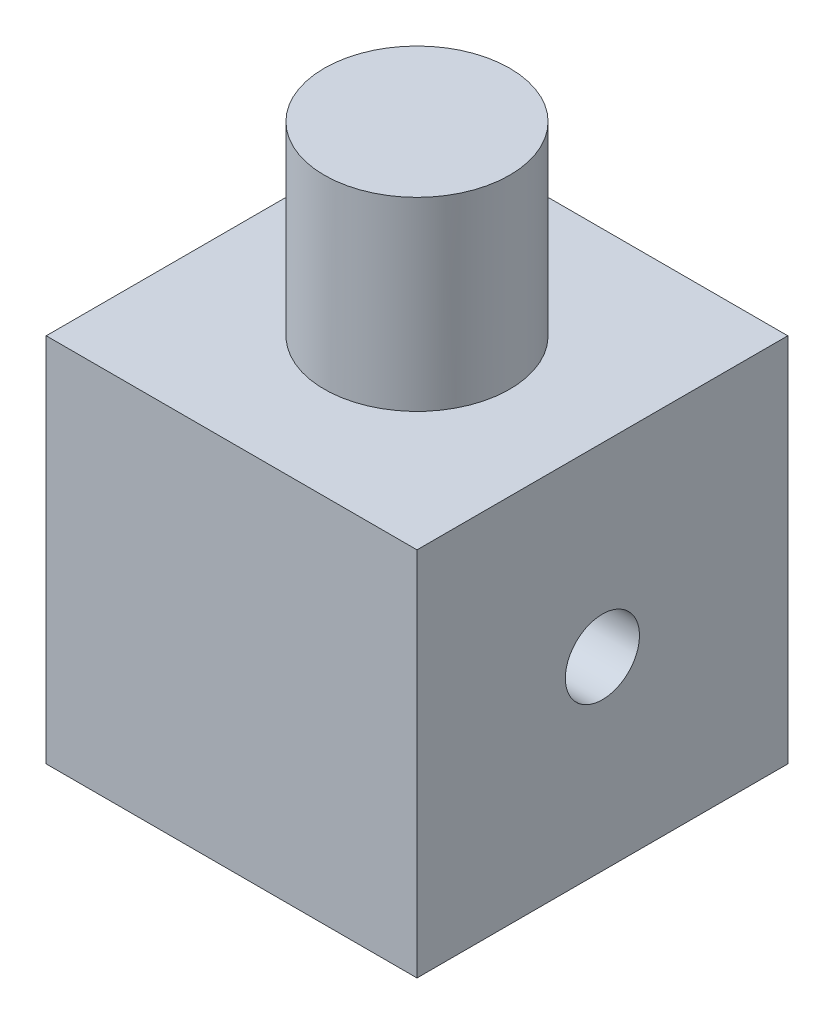
ISO-10303-21;
HEADER;
FILE_DESCRIPTION(('STEP AP214'),'2;1');
FILE_NAME('part.step','',(''),(''),'','','');
FILE_SCHEMA(('AUTOMOTIVE_DESIGN { 1 0 10303 214 1 1 1 1 }'));
ENDSEC;
DATA;
#1=APPLICATION_CONTEXT('core data for automotive mechanical design processes');
#2=APPLICATION_PROTOCOL_DEFINITION('international standard','automotive_design',2000,#1);
#3=PRODUCT_CONTEXT('',#1,'mechanical');
#4=PRODUCT('Part','Part','',(#3));
#5=PRODUCT_RELATED_PRODUCT_CATEGORY('part','',(#4));
#6=PRODUCT_DEFINITION_FORMATION('','',#4);
#7=PRODUCT_DEFINITION_CONTEXT('part definition',#1,'design');
#8=PRODUCT_DEFINITION('design','',#6,#7);
#9=PRODUCT_DEFINITION_SHAPE('','',#8);
#10=(LENGTH_UNIT() NAMED_UNIT(*) SI_UNIT(.MILLI.,.METRE.));
#11=(NAMED_UNIT(*) PLANE_ANGLE_UNIT() SI_UNIT($,.RADIAN.));
#12=(NAMED_UNIT(*) SI_UNIT($,.STERADIAN.) SOLID_ANGLE_UNIT());
#13=UNCERTAINTY_MEASURE_WITH_UNIT(LENGTH_MEASURE(1.E-05),#10,'distance_accuracy_value','');
#14=(GEOMETRIC_REPRESENTATION_CONTEXT(3) GLOBAL_UNCERTAINTY_ASSIGNED_CONTEXT((#13)) GLOBAL_UNIT_ASSIGNED_CONTEXT((#10,
#11,#12)) REPRESENTATION_CONTEXT('',''));
#15=CARTESIAN_POINT('',(0.,0.,0.));
#16=DIRECTION('',(0.,0.,1.));
#17=DIRECTION('',(1.,0.,0.));
#18=AXIS2_PLACEMENT_3D('',#15,#16,#17);
#19=CARTESIAN_POINT('',(0.,10.,0.));
#20=DIRECTION('',(0.,-1.,0.));
#21=DIRECTION('',(0.,0.,-1.));
#22=AXIS2_PLACEMENT_3D('',#19,#20,#21);
#23=PLANE('',#22);
#24=DIRECTION('',(0.,0.,1.));
#25=VECTOR('',#24,1.);
#26=CARTESIAN_POINT('',(-14.648193309658,10.,-16.7907746058219));
#27=LINE('',#26,#25);
#28=CARTESIAN_POINT('',(-14.648193309658,10.,-26.7907746058219));
#29=VERTEX_POINT('',#28);
#30=CARTESIAN_POINT('',(-14.648193309658,10.,-16.7907746058219));
#31=VERTEX_POINT('',#30);
#32=EDGE_CURVE('E91',#29,#31,#27,.T.);
#33=ORIENTED_EDGE('',*,*,#32,.T.);
#34=DIRECTION('',(1.,0.,0.));
#35=VECTOR('',#34,1.);
#36=CARTESIAN_POINT('',(-14.648193309658,10.,-16.7907746058219));
#37=LINE('',#36,#35);
#38=CARTESIAN_POINT('',(-4.648193309658,10.,-16.7907746058219));
#39=VERTEX_POINT('',#38);
#40=EDGE_CURVE('E86',#31,#39,#37,.T.);
#41=ORIENTED_EDGE('',*,*,#40,.T.);
#42=DIRECTION('',(0.,0.,-1.));
#43=VECTOR('',#42,1.);
#44=CARTESIAN_POINT('',(-4.648193309658,10.,-16.7907746058219));
#45=LINE('',#44,#43);
#46=CARTESIAN_POINT('',(-4.648193309658,10.,-26.7907746058219));
#47=VERTEX_POINT('',#46);
#48=EDGE_CURVE('E89',#39,#47,#45,.T.);
#49=ORIENTED_EDGE('',*,*,#48,.T.);
#50=DIRECTION('',(-1.,0.,0.));
#51=VECTOR('',#50,1.);
#52=CARTESIAN_POINT('',(-14.648193309658,10.,-26.7907746058219));
#53=LINE('',#52,#51);
#54=EDGE_CURVE('E55',#47,#29,#53,.T.);
#55=ORIENTED_EDGE('',*,*,#54,.T.);
#56=EDGE_LOOP('',(#33,#41,#49,#55));
#57=FACE_BOUND('',#56,.T.);
#58=CARTESIAN_POINT('',(-9.648193309658,10.,-21.7907746058219));
#59=DIRECTION('',(0.,-1.,0.));
#60=DIRECTION('',(0.,0.,-1.));
#61=AXIS2_PLACEMENT_3D('',#58,#59,#60);
#62=CIRCLE('',#61,2.5);
#63=CARTESIAN_POINT('',(-9.648193309658,10.,-24.2907746058219));
#64=VERTEX_POINT('',#63);
#65=EDGE_CURVE('E11',#64,#64,#62,.F.);
#66=ORIENTED_EDGE('',*,*,#65,.F.);
#67=EDGE_LOOP('',(#66));
#68=FACE_BOUND('',#67,.T.);
#69=ADVANCED_FACE('F33',(#57,#68),#23,.F.);
#70=CARTESIAN_POINT('',(-14.648193309658,10.,-16.7907746058219));
#71=DIRECTION('',(1.,0.,0.));
#72=DIRECTION('',(0.,0.,-1.));
#73=AXIS2_PLACEMENT_3D('',#70,#71,#72);
#74=PLANE('',#73);
#75=CARTESIAN_POINT('',(-14.648193309658,5.,-21.7907746058219));
#76=DIRECTION('',(-1.,0.,0.));
#77=DIRECTION('',(0.,0.,1.));
#78=AXIS2_PLACEMENT_3D('',#75,#76,#77);
#79=CIRCLE('',#78,1.);
#80=CARTESIAN_POINT('',(-14.648193309658,5.,-20.7907746058219));
#81=VERTEX_POINT('',#80);
#82=EDGE_CURVE('E156',#81,#81,#79,.T.);
#83=ORIENTED_EDGE('',*,*,#82,.F.);
#84=EDGE_LOOP('',(#83));
#85=FACE_BOUND('',#84,.T.);
#86=DIRECTION('',(0.,0.,1.));
#87=VECTOR('',#86,1.);
#88=CARTESIAN_POINT('',(-14.648193309658,0.,-16.7907746058219));
#89=LINE('',#88,#87);
#90=CARTESIAN_POINT('',(-14.648193309658,0.,-26.7907746058219));
#91=VERTEX_POINT('',#90);
#92=CARTESIAN_POINT('',(-14.648193309658,0.,-16.7907746058219));
#93=VERTEX_POINT('',#92);
#94=EDGE_CURVE('E105',#91,#93,#89,.T.);
#95=ORIENTED_EDGE('',*,*,#94,.T.);
#96=DIRECTION('',(0.,-1.,0.));
#97=VECTOR('',#96,1.);
#98=CARTESIAN_POINT('',(-14.648193309658,10.,-16.7907746058219));
#99=LINE('',#98,#97);
#100=EDGE_CURVE('E47',#31,#93,#99,.T.);
#101=ORIENTED_EDGE('',*,*,#100,.F.);
#102=ORIENTED_EDGE('',*,*,#32,.F.);
#103=DIRECTION('',(0.,-1.,0.));
#104=VECTOR('',#103,1.);
#105=CARTESIAN_POINT('',(-14.648193309658,10.,-26.7907746058219));
#106=LINE('',#105,#104);
#107=EDGE_CURVE('E101',#29,#91,#106,.T.);
#108=ORIENTED_EDGE('',*,*,#107,.T.);
#109=EDGE_LOOP('',(#95,#101,#102,#108));
#110=FACE_BOUND('',#109,.T.);
#111=ADVANCED_FACE('F35',(#85,#110),#74,.F.);
#112=CARTESIAN_POINT('',(-14.648193309658,10.,-16.7907746058219));
#113=DIRECTION('',(0.,0.,-1.));
#114=DIRECTION('',(-1.,0.,0.));
#115=AXIS2_PLACEMENT_3D('',#112,#113,#114);
#116=PLANE('',#115);
#117=DIRECTION('',(1.,0.,0.));
#118=VECTOR('',#117,1.);
#119=CARTESIAN_POINT('',(-14.648193309658,0.,-16.7907746058219));
#120=LINE('',#119,#118);
#121=CARTESIAN_POINT('',(-4.648193309658,0.,-16.7907746058219));
#122=VERTEX_POINT('',#121);
#123=EDGE_CURVE('E96',#93,#122,#120,.T.);
#124=ORIENTED_EDGE('',*,*,#123,.T.);
#125=DIRECTION('',(0.,-1.,0.));
#126=VECTOR('',#125,1.);
#127=CARTESIAN_POINT('',(-4.648193309658,10.,-16.7907746058219));
#128=LINE('',#127,#126);
#129=EDGE_CURVE('E94',#39,#122,#128,.T.);
#130=ORIENTED_EDGE('',*,*,#129,.F.);
#131=ORIENTED_EDGE('',*,*,#40,.F.);
#132=ORIENTED_EDGE('',*,*,#100,.T.);
#133=EDGE_LOOP('',(#124,#130,#131,#132));
#134=FACE_BOUND('',#133,.T.);
#135=ADVANCED_FACE('F95',(#134),#116,.F.);
#136=CARTESIAN_POINT('',(-4.648193309658,10.,-16.7907746058219));
#137=DIRECTION('',(-1.,0.,0.));
#138=DIRECTION('',(0.,0.,1.));
#139=AXIS2_PLACEMENT_3D('',#136,#137,#138);
#140=PLANE('',#139);
#141=CARTESIAN_POINT('',(-4.648193309658,5.,-21.7907746058219));
#142=DIRECTION('',(-1.,0.,0.));
#143=DIRECTION('',(0.,0.,1.));
#144=AXIS2_PLACEMENT_3D('',#141,#142,#143);
#145=CIRCLE('',#144,1.);
#146=CARTESIAN_POINT('',(-4.648193309658,5.,-20.7907746058219));
#147=VERTEX_POINT('',#146);
#148=EDGE_CURVE('E158',#147,#147,#145,.T.);
#149=ORIENTED_EDGE('',*,*,#148,.T.);
#150=EDGE_LOOP('',(#149));
#151=FACE_BOUND('',#150,.T.);
#152=DIRECTION('',(0.,0.,-1.));
#153=VECTOR('',#152,1.);
#154=CARTESIAN_POINT('',(-4.648193309658,0.,-16.7907746058219));
#155=LINE('',#154,#153);
#156=CARTESIAN_POINT('',(-4.648193309658,0.,-26.7907746058219));
#157=VERTEX_POINT('',#156);
#158=EDGE_CURVE('E72',#122,#157,#155,.T.);
#159=ORIENTED_EDGE('',*,*,#158,.T.);
#160=DIRECTION('',(0.,-1.,0.));
#161=VECTOR('',#160,1.);
#162=CARTESIAN_POINT('',(-4.648193309658,10.,-26.7907746058219));
#163=LINE('',#162,#161);
#164=EDGE_CURVE('E97',#47,#157,#163,.T.);
#165=ORIENTED_EDGE('',*,*,#164,.F.);
#166=ORIENTED_EDGE('',*,*,#48,.F.);
#167=ORIENTED_EDGE('',*,*,#129,.T.);
#168=EDGE_LOOP('',(#159,#165,#166,#167));
#169=FACE_BOUND('',#168,.T.);
#170=ADVANCED_FACE('F99',(#151,#169),#140,.F.);
#171=CARTESIAN_POINT('',(-14.648193309658,10.,-26.7907746058219));
#172=DIRECTION('',(0.,0.,1.));
#173=DIRECTION('',(1.,0.,0.));
#174=AXIS2_PLACEMENT_3D('',#171,#172,#173);
#175=PLANE('',#174);
#176=DIRECTION('',(-1.,0.,0.));
#177=VECTOR('',#176,1.);
#178=CARTESIAN_POINT('',(-14.648193309658,0.,-26.7907746058219));
#179=LINE('',#178,#177);
#180=EDGE_CURVE('E78',#157,#91,#179,.T.);
#181=ORIENTED_EDGE('',*,*,#180,.T.);
#182=ORIENTED_EDGE('',*,*,#107,.F.);
#183=ORIENTED_EDGE('',*,*,#54,.F.);
#184=ORIENTED_EDGE('',*,*,#164,.T.);
#185=EDGE_LOOP('',(#181,#182,#183,#184));
#186=FACE_BOUND('',#185,.T.);
#187=ADVANCED_FACE('F120',(#186),#175,.F.);
#188=CARTESIAN_POINT('',(0.,0.,0.));
#189=DIRECTION('',(0.,-1.,0.));
#190=DIRECTION('',(0.,0.,-1.));
#191=AXIS2_PLACEMENT_3D('',#188,#189,#190);
#192=PLANE('',#191);
#193=CARTESIAN_POINT('',(-9.648193309658,0.,-21.7907746058219));
#194=DIRECTION('',(0.,-1.,0.));
#195=DIRECTION('',(0.,0.,-1.));
#196=AXIS2_PLACEMENT_3D('',#193,#194,#195);
#197=CIRCLE('',#196,0.500000000000001);
#198=CARTESIAN_POINT('',(-9.648193309658,0.,-22.2907746058219));
#199=VERTEX_POINT('',#198);
#200=EDGE_CURVE('E153',#199,#199,#197,.T.);
#201=ORIENTED_EDGE('',*,*,#200,.F.);
#202=EDGE_LOOP('',(#201));
#203=FACE_BOUND('',#202,.T.);
#204=ORIENTED_EDGE('',*,*,#94,.F.);
#205=ORIENTED_EDGE('',*,*,#180,.F.);
#206=ORIENTED_EDGE('',*,*,#158,.F.);
#207=ORIENTED_EDGE('',*,*,#123,.F.);
#208=EDGE_LOOP('',(#204,#205,#206,#207));
#209=FACE_BOUND('',#208,.T.);
#210=ADVANCED_FACE('F117',(#203,#209),#192,.T.);
#211=CARTESIAN_POINT('',(-9.648193309658,15.,-21.7907746058219));
#212=DIRECTION('',(0.,-1.,0.));
#213=DIRECTION('',(0.,0.,-1.));
#214=AXIS2_PLACEMENT_3D('',#211,#212,#213);
#215=CYLINDRICAL_SURFACE('',#214,2.5);
#216=CARTESIAN_POINT('',(-9.648193309658,15.,-21.7907746058219));
#217=DIRECTION('',(0.,1.,0.));
#218=DIRECTION('',(0.,0.,1.));
#219=AXIS2_PLACEMENT_3D('',#216,#217,#218);
#220=CIRCLE('',#219,2.5);
#221=CARTESIAN_POINT('',(-9.648193309658,15.,-19.2907746058219));
#222=VERTEX_POINT('',#221);
#223=EDGE_CURVE('E108',#222,#222,#220,.T.);
#224=ORIENTED_EDGE('',*,*,#223,.F.);
#225=EDGE_LOOP('',(#224));
#226=FACE_BOUND('',#225,.T.);
#227=ORIENTED_EDGE('',*,*,#65,.T.);
#228=EDGE_LOOP('',(#227));
#229=FACE_BOUND('',#228,.T.);
#230=ADVANCED_FACE('F119',(#226,#229),#215,.T.);
#231=CARTESIAN_POINT('',(-9.648193309658,15.,-21.7907746058219));
#232=DIRECTION('',(0.,1.,0.));
#233=DIRECTION('',(0.,0.,1.));
#234=AXIS2_PLACEMENT_3D('',#231,#232,#233);
#235=PLANE('',#234);
#236=ORIENTED_EDGE('',*,*,#223,.T.);
#237=EDGE_LOOP('',(#236));
#238=FACE_BOUND('',#237,.T.);
#239=ADVANCED_FACE('F127',(#238),#235,.T.);
#240=CARTESIAN_POINT('',(-4.648193309658,5.,-21.7907746058219));
#241=DIRECTION('',(-1.,0.,0.));
#242=DIRECTION('',(0.,0.,1.));
#243=AXIS2_PLACEMENT_3D('',#240,#241,#242);
#244=CYLINDRICAL_SURFACE('',#243,1.);
#245=CARTESIAN_POINT('',(-9.648193309658,4.13397459621556,-22.2907746058219));
#246=CARTESIAN_POINT('',(-9.62213940556051,4.13397232635861,-22.290772787359));
#247=CARTESIAN_POINT('',(-9.59605260389551,4.13278099406146,-22.2887245911885));
#248=CARTESIAN_POINT('',(-9.54467967731938,4.12818816773949,-22.280636210771));
#249=CARTESIAN_POINT('',(-9.51939535213628,4.12478202972214,-22.274587638099));
#250=CARTESIAN_POINT('',(-9.47046747748604,4.11625326697307,-22.2588245801718));
#251=CARTESIAN_POINT('',(-9.44681598342121,4.11113978263376,-22.2491295820688));
#252=CARTESIAN_POINT('',(-9.40148120865963,4.09978667591569,-22.2264083685101));
#253=CARTESIAN_POINT('',(-9.37979803452677,4.09354699261967,-22.2133819728398));
#254=CARTESIAN_POINT('',(-9.33704044537924,4.0800156547128,-22.1831078760874));
#255=CARTESIAN_POINT('',(-9.31616374182123,4.07267968181023,-22.1656006238938));
#256=CARTESIAN_POINT('',(-9.27748911545464,4.05814008607147,-22.1274015096292));
#257=CARTESIAN_POINT('',(-9.25969272836624,4.05093653084375,-22.1067080687131));
#258=CARTESIAN_POINT('',(-9.22650973408417,4.03689261523525,-22.0610193875292));
#259=CARTESIAN_POINT('',(-9.21136642572823,4.03010946790914,-22.0358282003282));
#260=CARTESIAN_POINT('',(-9.18562288303512,4.01824621950235,-21.9828531191217));
#261=CARTESIAN_POINT('',(-9.17501978158941,4.01316504408129,-21.955070874891));
#262=CARTESIAN_POINT('',(-9.15944097900745,4.00559769377881,-21.8997970777849));
#263=CARTESIAN_POINT('',(-9.15411854648023,4.00295259889554,-21.8724255010663));
#264=CARTESIAN_POINT('',(-9.14811025032047,3.99996208076966,-21.8170599201708));
#265=CARTESIAN_POINT('',(-9.14742158126014,3.99961526607705,-21.7890663029));
#266=CARTESIAN_POINT('',(-9.15056664664317,4.00118509041775,-21.73585834361));
#267=CARTESIAN_POINT('',(-9.15401231741861,4.0029075205392,-21.7106140062335));
#268=CARTESIAN_POINT('',(-9.16463373161033,4.00812877370126,-21.6611177198628));
#269=CARTESIAN_POINT('',(-9.17180975414611,4.01162772966803,-21.636865845275));
#270=CARTESIAN_POINT('',(-9.1897345927029,4.02014208356173,-21.5896199100371));
#271=CARTESIAN_POINT('',(-9.20053146624403,4.025177792354,-21.5666478940643));
#272=CARTESIAN_POINT('',(-9.22532501775874,4.03631177006656,-21.5227862050653));
#273=CARTESIAN_POINT('',(-9.23932284130917,4.04241041921258,-21.5018972814026));
#274=CARTESIAN_POINT('',(-9.2716409854245,4.05577802800385,-21.4606877753728));
#275=CARTESIAN_POINT('',(-9.290244823821,4.06310312000912,-21.4406075683072));
#276=CARTESIAN_POINT('',(-9.33048817212308,4.07772829706594,-21.403722420673));
#277=CARTESIAN_POINT('',(-9.35212999579503,4.08502835867185,-21.3869200000348));
#278=CARTESIAN_POINT('',(-9.39951740587004,4.09927921953758,-21.3560219385008));
#279=CARTESIAN_POINT('',(-9.4254363211851,4.10617840004646,-21.3421659483329));
#280=CARTESIAN_POINT('',(-9.4796621453375,4.11812274860712,-21.3191150493213));
#281=CARTESIAN_POINT('',(-9.50796652616678,4.12316984976966,-21.3099152767165));
#282=CARTESIAN_POINT('',(-9.56380056529939,4.13027682091483,-21.2971845003094));
#283=CARTESIAN_POINT('',(-9.59121386917977,4.13254172075752,-21.2932620447619));
#284=CARTESIAN_POINT('',(-9.64639398041627,4.13441040319195,-21.2900161325162));
#285=CARTESIAN_POINT('',(-9.67416052421789,4.13401606555344,-21.2906894271644));
#286=CARTESIAN_POINT('',(-9.72602026894736,4.13082831729707,-21.2962565841499));
#287=CARTESIAN_POINT('',(-9.75018303521196,4.12830206246673,-21.3006806974657));
#288=CARTESIAN_POINT('',(-9.79737720279348,4.12152989224329,-21.3129264635057));
#289=CARTESIAN_POINT('',(-9.8204082350313,4.11728341997483,-21.3207492165101));
#290=CARTESIAN_POINT('',(-9.86589897510935,4.10731888960172,-21.3399508115195));
#291=CARTESIAN_POINT('',(-9.88828281808477,4.10154178378468,-21.3514775739756));
#292=CARTESIAN_POINT('',(-9.93092794542749,4.08921940251375,-21.377631073814));
#293=CARTESIAN_POINT('',(-9.95118813141464,4.08267373322426,-21.3922594036558));
#294=CARTESIAN_POINT('',(-9.99168269341977,4.06856000771832,-21.4263560222225));
#295=CARTESIAN_POINT('',(-10.0115918850168,4.06096708422855,-21.4462019696644));
#296=CARTESIAN_POINT('',(-10.0478994286548,4.04632882511054,-21.4890723581228));
#297=CARTESIAN_POINT('',(-10.0642965947733,4.03928367496146,-21.5120978684942));
#298=CARTESIAN_POINT('',(-10.093480172633,4.02629319154521,-21.5615069245425));
#299=CARTESIAN_POINT('',(-10.1061598687635,4.02038179163983,-21.5879630570349));
#300=CARTESIAN_POINT('',(-10.1267622615867,4.01058322520352,-21.6430134235014));
#301=CARTESIAN_POINT('',(-10.1346891353412,4.00669428161823,-21.6716057551258));
#302=CARTESIAN_POINT('',(-10.1448775917453,4.0016624590905,-21.7272847646567));
#303=CARTESIAN_POINT('',(-10.147592247596,4.00030036045872,-21.7542688838968));
#304=CARTESIAN_POINT('',(-10.1486149423852,3.99978934812466,-21.8083375987975));
#305=CARTESIAN_POINT('',(-10.14692452392,4.00063965966673,-21.8354221559692));
#306=CARTESIAN_POINT('',(-10.13948510626,4.00433015580928,-21.8870436019807));
#307=CARTESIAN_POINT('',(-10.1340108850285,4.00703552665605,-21.9116307647285));
#308=CARTESIAN_POINT('',(-10.1195298100071,4.01403953168688,-21.9594975819128));
#309=CARTESIAN_POINT('',(-10.1105224496136,4.01833839435091,-21.9827770482963));
#310=CARTESIAN_POINT('',(-10.0888297835726,4.02837034624387,-22.0284863089479));
#311=CARTESIAN_POINT('',(-10.0760036480449,4.03415691394691,-22.0508371771852));
#312=CARTESIAN_POINT('',(-10.0472143442377,4.04655933435,-22.0931619267157));
#313=CARTESIAN_POINT('',(-10.0312497351346,4.05317556742922,-22.1131347094798));
#314=CARTESIAN_POINT('',(-9.99479474010836,4.06735694862401,-22.1522316079553));
#315=CARTESIAN_POINT('',(-9.97401206577061,4.07495100399289,-22.1710734483052));
#316=CARTESIAN_POINT('',(-9.92946794894243,4.08968461822815,-22.2051062497348));
#317=CARTESIAN_POINT('',(-9.90570389918254,4.09682377093114,-22.2202939808857));
#318=CARTESIAN_POINT('',(-9.85487498640885,4.11000197374356,-22.246990145655));
#319=CARTESIAN_POINT('',(-9.82772954410435,4.11599912878815,-22.2583671387869));
#320=CARTESIAN_POINT('',(-9.77152710747743,4.12566921828897,-22.2762139605906));
#321=CARTESIAN_POINT('',(-9.74247686520007,4.12934991925121,-22.2827002014119));
#322=CARTESIAN_POINT('',(-9.70229063183258,4.13235363699479,-22.2879581097533));
#323=CARTESIAN_POINT('',(-9.69150936245921,4.13295935497527,-22.2890126583036));
#324=CARTESIAN_POINT('',(-9.66988506931672,4.13377032056022,-22.2904213083671));
#325=CARTESIAN_POINT('',(-9.659042041465,4.13397554137407,-22.2907753630219));
#326=CARTESIAN_POINT('',(-9.648193309658,4.13397459621556,-22.2907746058219));
#327=B_SPLINE_CURVE_WITH_KNOTS('',3,(#245,#246,#247,#248,#249,#250,#251,#252,#253,#254,#255,
#256,#257,#258,#259,#260,#261,#262,#263,#264,#265,#266,#267,#268,#269,#270,#271,#272,#273,#274,
#275,#276,#277,#278,#279,#280,#281,#282,#283,#284,#285,#286,#287,#288,#289,#290,#291,#292,#293,
#294,#295,#296,#297,#298,#299,#300,#301,#302,#303,#304,#305,#306,#307,#308,#309,#310,#311,#312,
#313,#314,#315,#316,#317,#318,#319,#320,#321,#322,#323,#324,#325,#326),.UNSPECIFIED.,.T.,.F.,(4,
2,2,2,2,2,2,2,2,2,2,2,2,2,2,2,2,2,2,2,2,2,2,2,2,2,2,2,2,2,2,2,2,2,2,2,2,2,2,2,4),(0.,
0.0781160612973564,0.156396446412402,0.234264297959443,0.312136362722574,0.396431156249115,
0.480767855421854,0.570789461193815,0.66075413481946,0.744317424839679,0.827830118430206,
0.904080487422697,0.98033656258728,1.05764767365573,1.13498649675136,1.21963595728445,
1.3043502412296,1.39444420864725,1.48444387105853,1.56731145427106,1.65012046594187,
1.72387091712013,1.79764526218032,1.87483648203044,1.95206743110024,2.03903371790307,
2.12602932489102,2.21532090706483,2.30453389904386,2.38556135194744,2.46656043396986,
2.54222212435746,2.61789466756007,2.69680375359736,2.7757491505036,2.8625512092522,
2.94942971422226,3.03905374518951,3.12837566501029,3.16090067592304,3.19342786246919),.UNSPECIFIED.);
#328=CARTESIAN_POINT('',(-9.648193309658,4.13397459621556,-22.2907746058219));
#329=VERTEX_POINT('',#328);
#330=EDGE_CURVE('E37',#329,#329,#327,.T.);
#331=ORIENTED_EDGE('',*,*,#330,.T.);
#332=EDGE_LOOP('',(#331));
#333=FACE_BOUND('',#332,.T.);
#334=ORIENTED_EDGE('',*,*,#148,.F.);
#335=EDGE_LOOP('',(#334));
#336=FACE_BOUND('',#335,.T.);
#337=ORIENTED_EDGE('',*,*,#82,.T.);
#338=EDGE_LOOP('',(#337));
#339=FACE_BOUND('',#338,.T.);
#340=ADVANCED_FACE('F140',(#333,#336,#339),#244,.F.);
#341=CARTESIAN_POINT('',(-9.648193309658,5.,-21.7907746058219));
#342=DIRECTION('',(0.,-1.,0.));
#343=DIRECTION('',(0.,0.,-1.));
#344=AXIS2_PLACEMENT_3D('',#341,#342,#343);
#345=CYLINDRICAL_SURFACE('',#344,0.500000000000001);
#346=ORIENTED_EDGE('',*,*,#200,.T.);
#347=EDGE_LOOP('',(#346));
#348=FACE_BOUND('',#347,.T.);
#349=ORIENTED_EDGE('',*,*,#330,.F.);
#350=EDGE_LOOP('',(#349));
#351=FACE_BOUND('',#350,.T.);
#352=ADVANCED_FACE('F144',(#348,#351),#345,.F.);
#353=CLOSED_SHELL('',(#69,#111,#135,#170,#187,#210,#230,#239,#340,#352));
#354=MANIFOLD_SOLID_BREP('B2',#353);
#355=ADVANCED_BREP_SHAPE_REPRESENTATION('',(#18,#354),#14);
#356=SHAPE_DEFINITION_REPRESENTATION(#9,#355);
ENDSEC;
END-ISO-10303-21;
